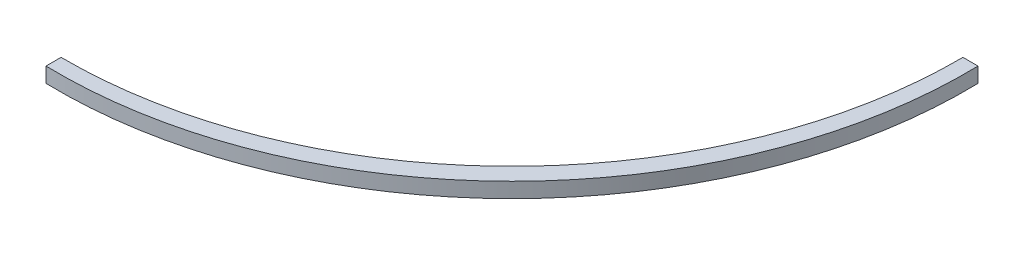
ISO-10303-21;
HEADER;
FILE_DESCRIPTION(('STEP AP214'),'2;1');
FILE_NAME('part.step','',(''),(''),'','','');
FILE_SCHEMA(('AUTOMOTIVE_DESIGN { 1 0 10303 214 1 1 1 1 }'));
ENDSEC;
DATA;
#1=APPLICATION_CONTEXT('core data for automotive mechanical design processes');
#2=APPLICATION_PROTOCOL_DEFINITION('international standard','automotive_design',2000,#1);
#3=PRODUCT_CONTEXT('',#1,'mechanical');
#4=PRODUCT('Part','Part','',(#3));
#5=PRODUCT_RELATED_PRODUCT_CATEGORY('part','',(#4));
#6=PRODUCT_DEFINITION_FORMATION('','',#4);
#7=PRODUCT_DEFINITION_CONTEXT('part definition',#1,'design');
#8=PRODUCT_DEFINITION('design','',#6,#7);
#9=PRODUCT_DEFINITION_SHAPE('','',#8);
#10=(LENGTH_UNIT() NAMED_UNIT(*) SI_UNIT(.MILLI.,.METRE.));
#11=(NAMED_UNIT(*) PLANE_ANGLE_UNIT() SI_UNIT($,.RADIAN.));
#12=(NAMED_UNIT(*) SI_UNIT($,.STERADIAN.) SOLID_ANGLE_UNIT());
#13=UNCERTAINTY_MEASURE_WITH_UNIT(LENGTH_MEASURE(1.E-05),#10,'distance_accuracy_value','');
#14=(GEOMETRIC_REPRESENTATION_CONTEXT(3) GLOBAL_UNCERTAINTY_ASSIGNED_CONTEXT((#13)) GLOBAL_UNIT_ASSIGNED_CONTEXT((#10,
#11,#12)) REPRESENTATION_CONTEXT('',''));
#15=CARTESIAN_POINT('',(0.,0.,0.));
#16=DIRECTION('',(0.,0.,1.));
#17=DIRECTION('',(1.,0.,0.));
#18=AXIS2_PLACEMENT_3D('',#15,#16,#17);
#19=CARTESIAN_POINT('',(0.,40.,40.));
#20=DIRECTION('',(-1.,0.,0.));
#21=DIRECTION('',(0.,0.,1.));
#22=AXIS2_PLACEMENT_3D('',#19,#20,#21);
#23=PLANE('',#22);
#24=DIRECTION('',(0.,0.,-1.));
#25=VECTOR('',#24,1.);
#26=CARTESIAN_POINT('',(0.,0.,40.));
#27=LINE('',#26,#25);
#28=CARTESIAN_POINT('',(5.23886489744996E-13,0.,40.));
#29=VERTEX_POINT('',#28);
#30=CARTESIAN_POINT('',(2.1163626406917E-13,0.,0.));
#31=VERTEX_POINT('',#30);
#32=EDGE_CURVE('E109',#29,#31,#27,.T.);
#33=ORIENTED_EDGE('',*,*,#32,.F.);
#34=DIRECTION('',(0.,-1.,0.));
#35=VECTOR('',#34,1.);
#36=CARTESIAN_POINT('',(5.23886489744996E-13,40.,40.));
#37=LINE('',#36,#35);
#38=CARTESIAN_POINT('',(5.23886489744996E-13,40.,40.));
#39=VERTEX_POINT('',#38);
#40=EDGE_CURVE('E11',#39,#29,#37,.T.);
#41=ORIENTED_EDGE('',*,*,#40,.F.);
#42=DIRECTION('',(0.,0.,-1.));
#43=VECTOR('',#42,1.);
#44=CARTESIAN_POINT('',(0.,40.,40.));
#45=LINE('',#44,#43);
#46=CARTESIAN_POINT('',(2.1163626406917E-13,40.,0.));
#47=VERTEX_POINT('',#46);
#48=EDGE_CURVE('E101',#39,#47,#45,.T.);
#49=ORIENTED_EDGE('',*,*,#48,.T.);
#50=DIRECTION('',(0.,-1.,0.));
#51=VECTOR('',#50,1.);
#52=CARTESIAN_POINT('',(2.1163626406917E-13,40.,0.));
#53=LINE('',#52,#51);
#54=EDGE_CURVE('E42',#47,#31,#53,.T.);
#55=ORIENTED_EDGE('',*,*,#54,.T.);
#56=EDGE_LOOP('',(#33,#41,#49,#55));
#57=FACE_BOUND('',#56,.T.);
#58=ADVANCED_FACE('F39',(#57),#23,.T.);
#59=CARTESIAN_POINT('',(29.1196386868984,40.,-1169.64955530217));
#60=DIRECTION('',(0.,-1.,0.));
#61=DIRECTION('',(0.,0.,-1.));
#62=AXIS2_PLACEMENT_3D('',#59,#60,#61);
#63=CYLINDRICAL_SURFACE('',#62,1210.);
#64=CARTESIAN_POINT('',(29.1196386868984,0.,-1169.64955530217));
#65=DIRECTION('',(0.,-1.,0.));
#66=DIRECTION('',(0.,0.,-1.));
#67=AXIS2_PLACEMENT_3D('',#64,#65,#66);
#68=CIRCLE('',#67,1210.);
#69=CARTESIAN_POINT('',(1238.76919398907,0.,-1198.76919398907));
#70=VERTEX_POINT('',#69);
#71=EDGE_CURVE('E104',#70,#29,#68,.T.);
#72=ORIENTED_EDGE('',*,*,#71,.F.);
#73=DIRECTION('',(0.,-1.,0.));
#74=VECTOR('',#73,1.);
#75=CARTESIAN_POINT('',(1238.76919398907,40.,-1198.76919398907));
#76=LINE('',#75,#74);
#77=CARTESIAN_POINT('',(1238.76919398907,40.,-1198.76919398907));
#78=VERTEX_POINT('',#77);
#79=EDGE_CURVE('E49',#78,#70,#76,.T.);
#80=ORIENTED_EDGE('',*,*,#79,.F.);
#81=CARTESIAN_POINT('',(29.1196386868984,40.,-1169.64955530217));
#82=DIRECTION('',(0.,-1.,0.));
#83=DIRECTION('',(0.,0.,-1.));
#84=AXIS2_PLACEMENT_3D('',#81,#82,#83);
#85=CIRCLE('',#84,1210.);
#86=EDGE_CURVE('E96',#78,#39,#85,.T.);
#87=ORIENTED_EDGE('',*,*,#86,.T.);
#88=ORIENTED_EDGE('',*,*,#40,.T.);
#89=EDGE_LOOP('',(#72,#80,#87,#88));
#90=FACE_BOUND('',#89,.T.);
#91=ADVANCED_FACE('F125',(#90),#63,.T.);
#92=CARTESIAN_POINT('',(1198.76919398907,40.,-1198.76919398907));
#93=DIRECTION('',(0.,0.,-1.));
#94=DIRECTION('',(-1.,0.,0.));
#95=AXIS2_PLACEMENT_3D('',#92,#93,#94);
#96=PLANE('',#95);
#97=DIRECTION('',(1.,0.,0.));
#98=VECTOR('',#97,1.);
#99=CARTESIAN_POINT('',(1198.76919398907,0.,-1198.76919398907));
#100=LINE('',#99,#98);
#101=CARTESIAN_POINT('',(1198.76919398907,0.,-1198.76919398907));
#102=VERTEX_POINT('',#101);
#103=EDGE_CURVE('E90',#102,#70,#100,.T.);
#104=ORIENTED_EDGE('',*,*,#103,.F.);
#105=DIRECTION('',(0.,-1.,0.));
#106=VECTOR('',#105,1.);
#107=CARTESIAN_POINT('',(1198.76919398907,40.,-1198.76919398907));
#108=LINE('',#107,#106);
#109=CARTESIAN_POINT('',(1198.76919398907,40.,-1198.76919398907));
#110=VERTEX_POINT('',#109);
#111=EDGE_CURVE('E85',#110,#102,#108,.T.);
#112=ORIENTED_EDGE('',*,*,#111,.F.);
#113=DIRECTION('',(1.,0.,0.));
#114=VECTOR('',#113,1.);
#115=CARTESIAN_POINT('',(1198.76919398907,40.,-1198.76919398907));
#116=LINE('',#115,#114);
#117=EDGE_CURVE('E88',#110,#78,#116,.T.);
#118=ORIENTED_EDGE('',*,*,#117,.T.);
#119=ORIENTED_EDGE('',*,*,#79,.T.);
#120=EDGE_LOOP('',(#104,#112,#118,#119));
#121=FACE_BOUND('',#120,.T.);
#122=ADVANCED_FACE('F87',(#121),#96,.T.);
#123=CARTESIAN_POINT('',(8.80174515603316,40.,-1189.96744883304));
#124=DIRECTION('',(0.,-1.,0.));
#125=DIRECTION('',(0.,0.,-1.));
#126=AXIS2_PLACEMENT_3D('',#123,#124,#125);
#127=CYLINDRICAL_SURFACE('',#126,1190.);
#128=CARTESIAN_POINT('',(8.80174515603316,0.,-1189.96744883304));
#129=DIRECTION('',(0.,1.,0.));
#130=DIRECTION('',(0.,0.,1.));
#131=AXIS2_PLACEMENT_3D('',#128,#129,#130);
#132=CIRCLE('',#131,1190.);
#133=EDGE_CURVE('E113',#31,#102,#132,.T.);
#134=ORIENTED_EDGE('',*,*,#133,.F.);
#135=ORIENTED_EDGE('',*,*,#54,.F.);
#136=CARTESIAN_POINT('',(8.80174515603316,40.,-1189.96744883304));
#137=DIRECTION('',(0.,1.,0.));
#138=DIRECTION('',(0.,0.,1.));
#139=AXIS2_PLACEMENT_3D('',#136,#137,#138);
#140=CIRCLE('',#139,1190.);
#141=EDGE_CURVE('E95',#47,#110,#140,.T.);
#142=ORIENTED_EDGE('',*,*,#141,.T.);
#143=ORIENTED_EDGE('',*,*,#111,.T.);
#144=EDGE_LOOP('',(#134,#135,#142,#143));
#145=FACE_BOUND('',#144,.T.);
#146=ADVANCED_FACE('F99',(#145),#127,.F.);
#147=CARTESIAN_POINT('',(8.80174515603316,40.,-1189.96744883304));
#148=DIRECTION('',(0.,1.,0.));
#149=DIRECTION('',(0.,0.,1.));
#150=AXIS2_PLACEMENT_3D('',#147,#148,#149);
#151=PLANE('',#150);
#152=ORIENTED_EDGE('',*,*,#48,.F.);
#153=ORIENTED_EDGE('',*,*,#86,.F.);
#154=ORIENTED_EDGE('',*,*,#117,.F.);
#155=ORIENTED_EDGE('',*,*,#141,.F.);
#156=EDGE_LOOP('',(#152,#153,#154,#155));
#157=FACE_BOUND('',#156,.T.);
#158=ADVANCED_FACE('F94',(#157),#151,.T.);
#159=CARTESIAN_POINT('',(8.80174515603316,0.,-1189.96744883304));
#160=DIRECTION('',(0.,1.,0.));
#161=DIRECTION('',(0.,0.,1.));
#162=AXIS2_PLACEMENT_3D('',#159,#160,#161);
#163=PLANE('',#162);
#164=ORIENTED_EDGE('',*,*,#32,.T.);
#165=ORIENTED_EDGE('',*,*,#133,.T.);
#166=ORIENTED_EDGE('',*,*,#103,.T.);
#167=ORIENTED_EDGE('',*,*,#71,.T.);
#168=EDGE_LOOP('',(#164,#165,#166,#167));
#169=FACE_BOUND('',#168,.T.);
#170=ADVANCED_FACE('F124',(#169),#163,.F.);
#171=CLOSED_SHELL('',(#58,#91,#122,#146,#158,#170));
#172=MANIFOLD_SOLID_BREP('B2',#171);
#173=ADVANCED_BREP_SHAPE_REPRESENTATION('',(#18,#172),#14);
#174=SHAPE_DEFINITION_REPRESENTATION(#9,#173);
ENDSEC;
END-ISO-10303-21;
